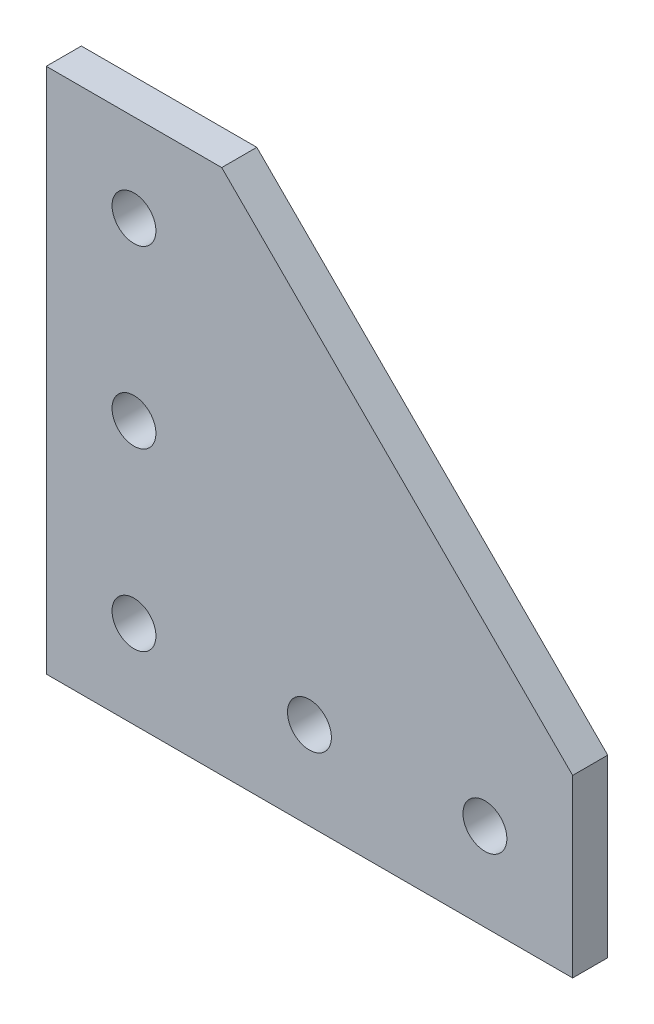
ISO-10303-21;
HEADER;
FILE_DESCRIPTION(('STEP AP214'),'2;1');
FILE_NAME('part.step','',(''),(''),'','','');
FILE_SCHEMA(('AUTOMOTIVE_DESIGN { 1 0 10303 214 1 1 1 1 }'));
ENDSEC;
DATA;
#1=APPLICATION_CONTEXT('core data for automotive mechanical design processes');
#2=APPLICATION_PROTOCOL_DEFINITION('international standard','automotive_design',2000,#1);
#3=PRODUCT_CONTEXT('',#1,'mechanical');
#4=PRODUCT('Part','Part','',(#3));
#5=PRODUCT_RELATED_PRODUCT_CATEGORY('part','',(#4));
#6=PRODUCT_DEFINITION_FORMATION('','',#4);
#7=PRODUCT_DEFINITION_CONTEXT('part definition',#1,'design');
#8=PRODUCT_DEFINITION('design','',#6,#7);
#9=PRODUCT_DEFINITION_SHAPE('','',#8);
#10=(LENGTH_UNIT() NAMED_UNIT(*) SI_UNIT(.MILLI.,.METRE.));
#11=(NAMED_UNIT(*) PLANE_ANGLE_UNIT() SI_UNIT($,.RADIAN.));
#12=(NAMED_UNIT(*) SI_UNIT($,.STERADIAN.) SOLID_ANGLE_UNIT());
#13=UNCERTAINTY_MEASURE_WITH_UNIT(LENGTH_MEASURE(1.E-05),#10,'distance_accuracy_value','');
#14=(GEOMETRIC_REPRESENTATION_CONTEXT(3) GLOBAL_UNCERTAINTY_ASSIGNED_CONTEXT((#13)) GLOBAL_UNIT_ASSIGNED_CONTEXT((#10,
#11,#12)) REPRESENTATION_CONTEXT('',''));
#15=CARTESIAN_POINT('',(0.,0.,0.));
#16=DIRECTION('',(0.,0.,1.));
#17=DIRECTION('',(1.,0.,0.));
#18=AXIS2_PLACEMENT_3D('',#15,#16,#17);
#19=CARTESIAN_POINT('',(30.,30.,0.));
#20=DIRECTION('',(0.,0.,1.));
#21=DIRECTION('',(1.,0.,0.));
#22=AXIS2_PLACEMENT_3D('',#19,#20,#21);
#23=PLANE('',#22);
#24=CARTESIAN_POINT('',(10.,30.,0.));
#25=DIRECTION('',(0.,0.,-1.));
#26=DIRECTION('',(1.,0.,0.));
#27=AXIS2_PLACEMENT_3D('',#24,#25,#26);
#28=CIRCLE('',#27,2.5);
#29=CARTESIAN_POINT('',(7.5,30.,0.));
#30=VERTEX_POINT('',#29);
#31=EDGE_CURVE('E130',#30,#30,#28,.T.);
#32=ORIENTED_EDGE('',*,*,#31,.F.);
#33=EDGE_LOOP('',(#32));
#34=FACE_BOUND('',#33,.T.);
#35=CARTESIAN_POINT('',(30.,10.,0.));
#36=DIRECTION('',(0.,0.,-1.));
#37=DIRECTION('',(1.,0.,0.));
#38=AXIS2_PLACEMENT_3D('',#35,#36,#37);
#39=CIRCLE('',#38,2.5);
#40=CARTESIAN_POINT('',(27.5,10.,0.));
#41=VERTEX_POINT('',#40);
#42=EDGE_CURVE('E107',#41,#41,#39,.T.);
#43=ORIENTED_EDGE('',*,*,#42,.F.);
#44=EDGE_LOOP('',(#43));
#45=FACE_BOUND('',#44,.T.);
#46=CARTESIAN_POINT('',(10.,50.,0.));
#47=DIRECTION('',(0.,0.,-1.));
#48=DIRECTION('',(1.,0.,0.));
#49=AXIS2_PLACEMENT_3D('',#46,#47,#48);
#50=CIRCLE('',#49,2.5);
#51=CARTESIAN_POINT('',(7.5,50.,0.));
#52=VERTEX_POINT('',#51);
#53=EDGE_CURVE('E161',#52,#52,#50,.T.);
#54=ORIENTED_EDGE('',*,*,#53,.F.);
#55=EDGE_LOOP('',(#54));
#56=FACE_BOUND('',#55,.T.);
#57=CARTESIAN_POINT('',(10.,10.,0.));
#58=DIRECTION('',(0.,0.,-1.));
#59=DIRECTION('',(1.,0.,0.));
#60=AXIS2_PLACEMENT_3D('',#57,#58,#59);
#61=CIRCLE('',#60,2.5);
#62=CARTESIAN_POINT('',(7.5,10.,0.));
#63=VERTEX_POINT('',#62);
#64=EDGE_CURVE('E178',#63,#63,#61,.T.);
#65=ORIENTED_EDGE('',*,*,#64,.F.);
#66=EDGE_LOOP('',(#65));
#67=FACE_BOUND('',#66,.T.);
#68=CARTESIAN_POINT('',(50.,10.,0.));
#69=DIRECTION('',(0.,0.,-1.));
#70=DIRECTION('',(1.,0.,0.));
#71=AXIS2_PLACEMENT_3D('',#68,#69,#70);
#72=CIRCLE('',#71,2.5);
#73=CARTESIAN_POINT('',(47.5,10.,0.));
#74=VERTEX_POINT('',#73);
#75=EDGE_CURVE('E155',#74,#74,#72,.T.);
#76=ORIENTED_EDGE('',*,*,#75,.F.);
#77=EDGE_LOOP('',(#76));
#78=FACE_BOUND('',#77,.T.);
#79=DIRECTION('',(1.,0.,0.));
#80=VECTOR('',#79,1.);
#81=CARTESIAN_POINT('',(0.,0.,0.));
#82=LINE('',#81,#80);
#83=CARTESIAN_POINT('',(0.,0.,0.));
#84=VERTEX_POINT('',#83);
#85=CARTESIAN_POINT('',(60.,0.,0.));
#86=VERTEX_POINT('',#85);
#87=EDGE_CURVE('E26',#84,#86,#82,.T.);
#88=ORIENTED_EDGE('',*,*,#87,.F.);
#89=DIRECTION('',(0.,1.,0.));
#90=VECTOR('',#89,1.);
#91=CARTESIAN_POINT('',(0.,0.,0.));
#92=LINE('',#91,#90);
#93=CARTESIAN_POINT('',(0.,60.,0.));
#94=VERTEX_POINT('',#93);
#95=EDGE_CURVE('E151',#84,#94,#92,.T.);
#96=ORIENTED_EDGE('',*,*,#95,.T.);
#97=DIRECTION('',(1.,0.,0.));
#98=VECTOR('',#97,1.);
#99=CARTESIAN_POINT('',(0.,60.,0.));
#100=LINE('',#99,#98);
#101=CARTESIAN_POINT('',(20.,60.,0.));
#102=VERTEX_POINT('',#101);
#103=EDGE_CURVE('E146',#94,#102,#100,.T.);
#104=ORIENTED_EDGE('',*,*,#103,.T.);
#105=DIRECTION('',(0.707106781186548,-0.707106781186548,0.));
#106=VECTOR('',#105,1.);
#107=CARTESIAN_POINT('',(20.,60.,0.));
#108=LINE('',#107,#106);
#109=CARTESIAN_POINT('',(60.,20.,0.));
#110=VERTEX_POINT('',#109);
#111=EDGE_CURVE('E156',#102,#110,#108,.T.);
#112=ORIENTED_EDGE('',*,*,#111,.T.);
#113=DIRECTION('',(0.,1.,0.));
#114=VECTOR('',#113,1.);
#115=CARTESIAN_POINT('',(60.,0.,0.));
#116=LINE('',#115,#114);
#117=EDGE_CURVE('E170',#86,#110,#116,.T.);
#118=ORIENTED_EDGE('',*,*,#117,.F.);
#119=EDGE_LOOP('',(#88,#96,#104,#112,#118));
#120=FACE_BOUND('',#119,.T.);
#121=ADVANCED_FACE('F15',(#34,#45,#56,#67,#78,#120),#23,.F.);
#122=CARTESIAN_POINT('',(30.,30.,4.));
#123=DIRECTION('',(0.,0.,1.));
#124=DIRECTION('',(1.,0.,0.));
#125=AXIS2_PLACEMENT_3D('',#122,#123,#124);
#126=PLANE('',#125);
#127=CARTESIAN_POINT('',(10.,30.,4.));
#128=DIRECTION('',(0.,0.,-1.));
#129=DIRECTION('',(1.,0.,0.));
#130=AXIS2_PLACEMENT_3D('',#127,#128,#129);
#131=CIRCLE('',#130,2.5);
#132=CARTESIAN_POINT('',(7.5,30.,4.));
#133=VERTEX_POINT('',#132);
#134=EDGE_CURVE('E149',#133,#133,#131,.T.);
#135=ORIENTED_EDGE('',*,*,#134,.T.);
#136=EDGE_LOOP('',(#135));
#137=FACE_BOUND('',#136,.T.);
#138=CARTESIAN_POINT('',(30.,10.,4.));
#139=DIRECTION('',(0.,0.,-1.));
#140=DIRECTION('',(1.,0.,0.));
#141=AXIS2_PLACEMENT_3D('',#138,#139,#140);
#142=CIRCLE('',#141,2.5);
#143=CARTESIAN_POINT('',(27.5,10.,4.));
#144=VERTEX_POINT('',#143);
#145=EDGE_CURVE('E124',#144,#144,#142,.T.);
#146=ORIENTED_EDGE('',*,*,#145,.T.);
#147=EDGE_LOOP('',(#146));
#148=FACE_BOUND('',#147,.T.);
#149=CARTESIAN_POINT('',(10.,50.,4.));
#150=DIRECTION('',(0.,0.,-1.));
#151=DIRECTION('',(1.,0.,0.));
#152=AXIS2_PLACEMENT_3D('',#149,#150,#151);
#153=CIRCLE('',#152,2.5);
#154=CARTESIAN_POINT('',(7.5,50.,4.));
#155=VERTEX_POINT('',#154);
#156=EDGE_CURVE('E114',#155,#155,#153,.T.);
#157=ORIENTED_EDGE('',*,*,#156,.T.);
#158=EDGE_LOOP('',(#157));
#159=FACE_BOUND('',#158,.T.);
#160=CARTESIAN_POINT('',(10.,10.,4.));
#161=DIRECTION('',(0.,0.,-1.));
#162=DIRECTION('',(1.,0.,0.));
#163=AXIS2_PLACEMENT_3D('',#160,#161,#162);
#164=CIRCLE('',#163,2.5);
#165=CARTESIAN_POINT('',(7.5,10.,4.));
#166=VERTEX_POINT('',#165);
#167=EDGE_CURVE('E128',#166,#166,#164,.T.);
#168=ORIENTED_EDGE('',*,*,#167,.T.);
#169=EDGE_LOOP('',(#168));
#170=FACE_BOUND('',#169,.T.);
#171=CARTESIAN_POINT('',(50.,10.,4.));
#172=DIRECTION('',(0.,0.,-1.));
#173=DIRECTION('',(1.,0.,0.));
#174=AXIS2_PLACEMENT_3D('',#171,#172,#173);
#175=CIRCLE('',#174,2.5);
#176=CARTESIAN_POINT('',(47.5,10.,4.));
#177=VERTEX_POINT('',#176);
#178=EDGE_CURVE('E174',#177,#177,#175,.T.);
#179=ORIENTED_EDGE('',*,*,#178,.T.);
#180=EDGE_LOOP('',(#179));
#181=FACE_BOUND('',#180,.T.);
#182=DIRECTION('',(1.,0.,0.));
#183=VECTOR('',#182,1.);
#184=CARTESIAN_POINT('',(0.,0.,4.));
#185=LINE('',#184,#183);
#186=CARTESIAN_POINT('',(0.,0.,4.));
#187=VERTEX_POINT('',#186);
#188=CARTESIAN_POINT('',(60.,0.,4.));
#189=VERTEX_POINT('',#188);
#190=EDGE_CURVE('E10',#187,#189,#185,.T.);
#191=ORIENTED_EDGE('',*,*,#190,.T.);
#192=DIRECTION('',(0.,1.,0.));
#193=VECTOR('',#192,1.);
#194=CARTESIAN_POINT('',(60.,0.,4.));
#195=LINE('',#194,#193);
#196=CARTESIAN_POINT('',(60.,20.,4.));
#197=VERTEX_POINT('',#196);
#198=EDGE_CURVE('E19',#189,#197,#195,.T.);
#199=ORIENTED_EDGE('',*,*,#198,.T.);
#200=DIRECTION('',(-0.707106781186548,0.707106781186548,0.));
#201=VECTOR('',#200,1.);
#202=CARTESIAN_POINT('',(20.,60.,4.));
#203=LINE('',#202,#201);
#204=CARTESIAN_POINT('',(20.,60.,4.));
#205=VERTEX_POINT('',#204);
#206=EDGE_CURVE('E160',#197,#205,#203,.T.);
#207=ORIENTED_EDGE('',*,*,#206,.T.);
#208=DIRECTION('',(-1.,0.,0.));
#209=VECTOR('',#208,1.);
#210=CARTESIAN_POINT('',(0.,60.,4.));
#211=LINE('',#210,#209);
#212=CARTESIAN_POINT('',(0.,60.,4.));
#213=VERTEX_POINT('',#212);
#214=EDGE_CURVE('E142',#205,#213,#211,.T.);
#215=ORIENTED_EDGE('',*,*,#214,.T.);
#216=DIRECTION('',(0.,-1.,0.));
#217=VECTOR('',#216,1.);
#218=CARTESIAN_POINT('',(0.,0.,4.));
#219=LINE('',#218,#217);
#220=EDGE_CURVE('E134',#213,#187,#219,.T.);
#221=ORIENTED_EDGE('',*,*,#220,.T.);
#222=EDGE_LOOP('',(#191,#199,#207,#215,#221));
#223=FACE_BOUND('',#222,.T.);
#224=ADVANCED_FACE('F214',(#137,#148,#159,#170,#181,#223),#126,.T.);
#225=CARTESIAN_POINT('',(0.,0.,0.));
#226=DIRECTION('',(0.,-1.,0.));
#227=DIRECTION('',(0.,0.,-1.));
#228=AXIS2_PLACEMENT_3D('',#225,#226,#227);
#229=PLANE('',#228);
#230=ORIENTED_EDGE('',*,*,#87,.T.);
#231=DIRECTION('',(0.,0.,1.));
#232=VECTOR('',#231,1.);
#233=CARTESIAN_POINT('',(60.,0.,0.));
#234=LINE('',#233,#232);
#235=EDGE_CURVE('E141',#86,#189,#234,.T.);
#236=ORIENTED_EDGE('',*,*,#235,.T.);
#237=ORIENTED_EDGE('',*,*,#190,.F.);
#238=DIRECTION('',(0.,0.,1.));
#239=VECTOR('',#238,1.);
#240=CARTESIAN_POINT('',(0.,0.,0.));
#241=LINE('',#240,#239);
#242=EDGE_CURVE('E138',#84,#187,#241,.T.);
#243=ORIENTED_EDGE('',*,*,#242,.F.);
#244=EDGE_LOOP('',(#230,#236,#237,#243));
#245=FACE_BOUND('',#244,.T.);
#246=ADVANCED_FACE('F217',(#245),#229,.T.);
#247=CARTESIAN_POINT('',(60.,0.,0.));
#248=DIRECTION('',(1.,0.,0.));
#249=DIRECTION('',(0.,1.,0.));
#250=AXIS2_PLACEMENT_3D('',#247,#248,#249);
#251=PLANE('',#250);
#252=ORIENTED_EDGE('',*,*,#117,.T.);
#253=DIRECTION('',(0.,0.,1.));
#254=VECTOR('',#253,1.);
#255=CARTESIAN_POINT('',(60.,20.,0.));
#256=LINE('',#255,#254);
#257=EDGE_CURVE('E173',#110,#197,#256,.T.);
#258=ORIENTED_EDGE('',*,*,#257,.T.);
#259=ORIENTED_EDGE('',*,*,#198,.F.);
#260=ORIENTED_EDGE('',*,*,#235,.F.);
#261=EDGE_LOOP('',(#252,#258,#259,#260));
#262=FACE_BOUND('',#261,.T.);
#263=ADVANCED_FACE('F304',(#262),#251,.T.);
#264=CARTESIAN_POINT('',(60.,20.,0.));
#265=DIRECTION('',(0.707106781186548,0.707106781186548,0.));
#266=DIRECTION('',(0.,0.,-1.));
#267=AXIS2_PLACEMENT_3D('',#264,#265,#266);
#268=PLANE('',#267);
#269=ORIENTED_EDGE('',*,*,#111,.F.);
#270=DIRECTION('',(0.,0.,1.));
#271=VECTOR('',#270,1.);
#272=CARTESIAN_POINT('',(20.,60.,0.));
#273=LINE('',#272,#271);
#274=EDGE_CURVE('E145',#102,#205,#273,.T.);
#275=ORIENTED_EDGE('',*,*,#274,.T.);
#276=ORIENTED_EDGE('',*,*,#206,.F.);
#277=ORIENTED_EDGE('',*,*,#257,.F.);
#278=EDGE_LOOP('',(#269,#275,#276,#277));
#279=FACE_BOUND('',#278,.T.);
#280=ADVANCED_FACE('F310',(#279),#268,.T.);
#281=CARTESIAN_POINT('',(20.,60.,0.));
#282=DIRECTION('',(0.,1.,0.));
#283=DIRECTION('',(1.,0.,0.));
#284=AXIS2_PLACEMENT_3D('',#281,#282,#283);
#285=PLANE('',#284);
#286=ORIENTED_EDGE('',*,*,#103,.F.);
#287=DIRECTION('',(0.,0.,1.));
#288=VECTOR('',#287,1.);
#289=CARTESIAN_POINT('',(0.,60.,0.));
#290=LINE('',#289,#288);
#291=EDGE_CURVE('E137',#94,#213,#290,.T.);
#292=ORIENTED_EDGE('',*,*,#291,.T.);
#293=ORIENTED_EDGE('',*,*,#214,.F.);
#294=ORIENTED_EDGE('',*,*,#274,.F.);
#295=EDGE_LOOP('',(#286,#292,#293,#294));
#296=FACE_BOUND('',#295,.T.);
#297=ADVANCED_FACE('F17',(#296),#285,.T.);
#298=CARTESIAN_POINT('',(0.,60.,0.));
#299=DIRECTION('',(-1.,0.,0.));
#300=DIRECTION('',(0.,0.,1.));
#301=AXIS2_PLACEMENT_3D('',#298,#299,#300);
#302=PLANE('',#301);
#303=ORIENTED_EDGE('',*,*,#95,.F.);
#304=ORIENTED_EDGE('',*,*,#242,.T.);
#305=ORIENTED_EDGE('',*,*,#220,.F.);
#306=ORIENTED_EDGE('',*,*,#291,.F.);
#307=EDGE_LOOP('',(#303,#304,#305,#306));
#308=FACE_BOUND('',#307,.T.);
#309=ADVANCED_FACE('F240',(#308),#302,.T.);
#310=CARTESIAN_POINT('',(50.,10.,0.));
#311=DIRECTION('',(0.,0.,1.));
#312=DIRECTION('',(1.,0.,0.));
#313=AXIS2_PLACEMENT_3D('',#310,#311,#312);
#314=CYLINDRICAL_SURFACE('',#313,2.5);
#315=ORIENTED_EDGE('',*,*,#178,.F.);
#316=DIRECTION('',(0.,0.,-1.));
#317=VECTOR('',#316,1.);
#318=CARTESIAN_POINT('',(47.5,10.,0.));
#319=LINE('',#318,#317);
#320=EDGE_CURVE('E169',#177,#74,#319,.T.);
#321=ORIENTED_EDGE('',*,*,#320,.T.);
#322=ORIENTED_EDGE('',*,*,#75,.T.);
#323=ORIENTED_EDGE('',*,*,#320,.F.);
#324=EDGE_LOOP('',(#315,#321,#322,#323));
#325=FACE_BOUND('',#324,.T.);
#326=ADVANCED_FACE('F225',(#325),#314,.F.);
#327=CARTESIAN_POINT('',(10.,10.,0.));
#328=DIRECTION('',(0.,0.,1.));
#329=DIRECTION('',(1.,0.,0.));
#330=AXIS2_PLACEMENT_3D('',#327,#328,#329);
#331=CYLINDRICAL_SURFACE('',#330,2.5);
#332=ORIENTED_EDGE('',*,*,#167,.F.);
#333=DIRECTION('',(0.,0.,-1.));
#334=VECTOR('',#333,1.);
#335=CARTESIAN_POINT('',(7.5,10.,0.));
#336=LINE('',#335,#334);
#337=EDGE_CURVE('E197',#166,#63,#336,.T.);
#338=ORIENTED_EDGE('',*,*,#337,.T.);
#339=ORIENTED_EDGE('',*,*,#64,.T.);
#340=ORIENTED_EDGE('',*,*,#337,.F.);
#341=EDGE_LOOP('',(#332,#338,#339,#340));
#342=FACE_BOUND('',#341,.T.);
#343=ADVANCED_FACE('F376',(#342),#331,.F.);
#344=CARTESIAN_POINT('',(10.,50.,0.));
#345=DIRECTION('',(0.,0.,1.));
#346=DIRECTION('',(1.,0.,0.));
#347=AXIS2_PLACEMENT_3D('',#344,#345,#346);
#348=CYLINDRICAL_SURFACE('',#347,2.5);
#349=ORIENTED_EDGE('',*,*,#156,.F.);
#350=DIRECTION('',(0.,0.,-1.));
#351=VECTOR('',#350,1.);
#352=CARTESIAN_POINT('',(7.5,50.,0.));
#353=LINE('',#352,#351);
#354=EDGE_CURVE('E122',#155,#52,#353,.T.);
#355=ORIENTED_EDGE('',*,*,#354,.T.);
#356=ORIENTED_EDGE('',*,*,#53,.T.);
#357=ORIENTED_EDGE('',*,*,#354,.F.);
#358=EDGE_LOOP('',(#349,#355,#356,#357));
#359=FACE_BOUND('',#358,.T.);
#360=ADVANCED_FACE('F211',(#359),#348,.F.);
#361=CARTESIAN_POINT('',(30.,10.,0.));
#362=DIRECTION('',(0.,0.,1.));
#363=DIRECTION('',(1.,0.,0.));
#364=AXIS2_PLACEMENT_3D('',#361,#362,#363);
#365=CYLINDRICAL_SURFACE('',#364,2.5);
#366=ORIENTED_EDGE('',*,*,#145,.F.);
#367=DIRECTION('',(0.,0.,-1.));
#368=VECTOR('',#367,1.);
#369=CARTESIAN_POINT('',(27.5,10.,0.));
#370=LINE('',#369,#368);
#371=EDGE_CURVE('E110',#144,#41,#370,.T.);
#372=ORIENTED_EDGE('',*,*,#371,.T.);
#373=ORIENTED_EDGE('',*,*,#42,.T.);
#374=ORIENTED_EDGE('',*,*,#371,.F.);
#375=EDGE_LOOP('',(#366,#372,#373,#374));
#376=FACE_BOUND('',#375,.T.);
#377=ADVANCED_FACE('F109',(#376),#365,.F.);
#378=CARTESIAN_POINT('',(10.,30.,0.));
#379=DIRECTION('',(0.,0.,1.));
#380=DIRECTION('',(1.,0.,0.));
#381=AXIS2_PLACEMENT_3D('',#378,#379,#380);
#382=CYLINDRICAL_SURFACE('',#381,2.5);
#383=ORIENTED_EDGE('',*,*,#134,.F.);
#384=DIRECTION('',(0.,0.,-1.));
#385=VECTOR('',#384,1.);
#386=CARTESIAN_POINT('',(7.5,30.,0.));
#387=LINE('',#386,#385);
#388=EDGE_CURVE('E132',#133,#30,#387,.T.);
#389=ORIENTED_EDGE('',*,*,#388,.T.);
#390=ORIENTED_EDGE('',*,*,#31,.T.);
#391=ORIENTED_EDGE('',*,*,#388,.F.);
#392=EDGE_LOOP('',(#383,#389,#390,#391));
#393=FACE_BOUND('',#392,.T.);
#394=ADVANCED_FACE('F340',(#393),#382,.F.);
#395=CLOSED_SHELL('',(#121,#224,#246,#263,#280,#297,#309,#326,#343,#360,#377,#394));
#396=MANIFOLD_SOLID_BREP('B1',#395);
#397=ADVANCED_BREP_SHAPE_REPRESENTATION('',(#18,#396),#14);
#398=SHAPE_DEFINITION_REPRESENTATION(#9,#397);
ENDSEC;
END-ISO-10303-21;
